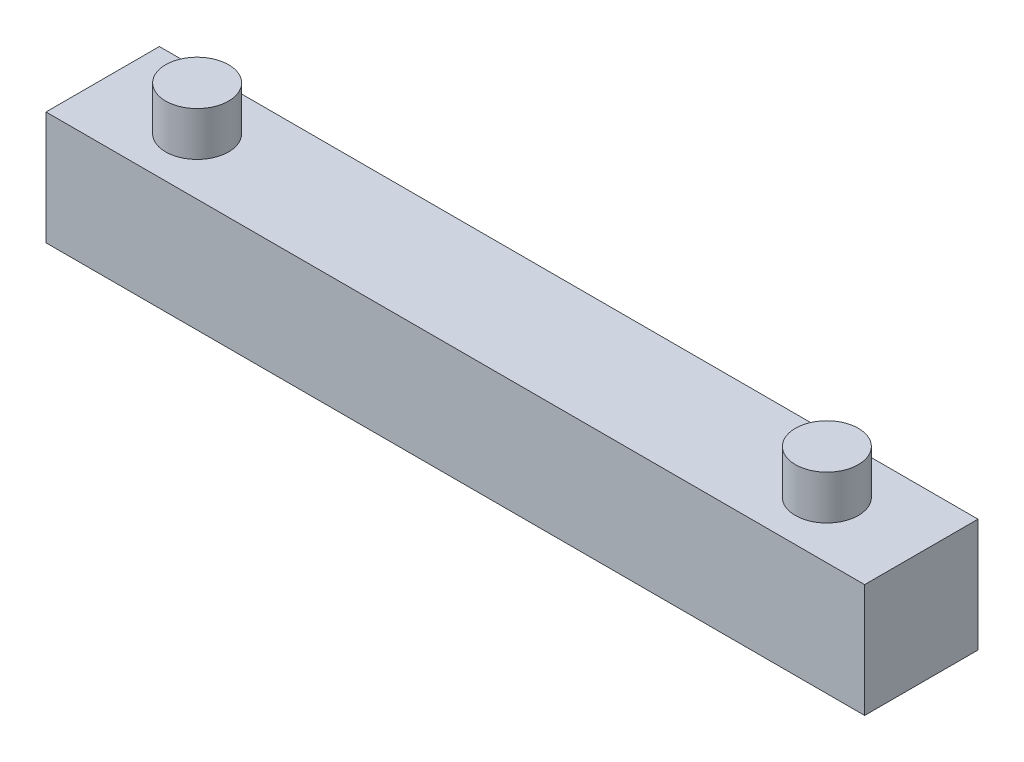
ISO-10303-21;
HEADER;
FILE_DESCRIPTION(('STEP AP214'),'2;1');
FILE_NAME('part.step','',(''),(''),'','','');
FILE_SCHEMA(('AUTOMOTIVE_DESIGN { 1 0 10303 214 1 1 1 1 }'));
ENDSEC;
DATA;
#1=APPLICATION_CONTEXT('core data for automotive mechanical design processes');
#2=APPLICATION_PROTOCOL_DEFINITION('international standard','automotive_design',2000,#1);
#3=PRODUCT_CONTEXT('',#1,'mechanical');
#4=PRODUCT('Part','Part','',(#3));
#5=PRODUCT_RELATED_PRODUCT_CATEGORY('part','',(#4));
#6=PRODUCT_DEFINITION_FORMATION('','',#4);
#7=PRODUCT_DEFINITION_CONTEXT('part definition',#1,'design');
#8=PRODUCT_DEFINITION('design','',#6,#7);
#9=PRODUCT_DEFINITION_SHAPE('','',#8);
#10=(LENGTH_UNIT() NAMED_UNIT(*) SI_UNIT(.MILLI.,.METRE.));
#11=(NAMED_UNIT(*) PLANE_ANGLE_UNIT() SI_UNIT($,.RADIAN.));
#12=(NAMED_UNIT(*) SI_UNIT($,.STERADIAN.) SOLID_ANGLE_UNIT());
#13=UNCERTAINTY_MEASURE_WITH_UNIT(LENGTH_MEASURE(1.E-05),#10,'distance_accuracy_value','');
#14=(GEOMETRIC_REPRESENTATION_CONTEXT(3) GLOBAL_UNCERTAINTY_ASSIGNED_CONTEXT((#13)) GLOBAL_UNIT_ASSIGNED_CONTEXT((#10,
#11,#12)) REPRESENTATION_CONTEXT('',''));
#15=CARTESIAN_POINT('',(0.,0.,0.));
#16=DIRECTION('',(0.,0.,1.));
#17=DIRECTION('',(1.,0.,0.));
#18=AXIS2_PLACEMENT_3D('',#15,#16,#17);
#19=CARTESIAN_POINT('',(0.,9.,0.));
#20=DIRECTION('',(0.,1.,0.));
#21=DIRECTION('',(0.,0.,1.));
#22=AXIS2_PLACEMENT_3D('',#19,#20,#21);
#23=PLANE('',#22);
#24=CARTESIAN_POINT('',(7.5,9.,4.5));
#25=DIRECTION('',(0.,1.,0.));
#26=DIRECTION('',(0.,0.,1.));
#27=AXIS2_PLACEMENT_3D('',#24,#25,#26);
#28=CIRCLE('',#27,2.5);
#29=CARTESIAN_POINT('',(7.5,9.,7.));
#30=VERTEX_POINT('',#29);
#31=EDGE_CURVE('E111',#30,#30,#28,.T.);
#32=ORIENTED_EDGE('',*,*,#31,.F.);
#33=EDGE_LOOP('',(#32));
#34=FACE_BOUND('',#33,.T.);
#35=DIRECTION('',(0.,0.,1.));
#36=VECTOR('',#35,1.);
#37=CARTESIAN_POINT('',(0.,9.,0.));
#38=LINE('',#37,#36);
#39=CARTESIAN_POINT('',(0.,9.,0.));
#40=VERTEX_POINT('',#39);
#41=CARTESIAN_POINT('',(0.,9.,9.));
#42=VERTEX_POINT('',#41);
#43=EDGE_CURVE('E85',#40,#42,#38,.T.);
#44=ORIENTED_EDGE('',*,*,#43,.T.);
#45=DIRECTION('',(1.,0.,0.));
#46=VECTOR('',#45,1.);
#47=CARTESIAN_POINT('',(0.,9.,9.));
#48=LINE('',#47,#46);
#49=CARTESIAN_POINT('',(65.,9.,9.));
#50=VERTEX_POINT('',#49);
#51=EDGE_CURVE('E80',#42,#50,#48,.T.);
#52=ORIENTED_EDGE('',*,*,#51,.T.);
#53=DIRECTION('',(0.,0.,-1.));
#54=VECTOR('',#53,1.);
#55=CARTESIAN_POINT('',(65.,9.,0.));
#56=LINE('',#55,#54);
#57=CARTESIAN_POINT('',(65.,9.,0.));
#58=VERTEX_POINT('',#57);
#59=EDGE_CURVE('E83',#50,#58,#56,.T.);
#60=ORIENTED_EDGE('',*,*,#59,.T.);
#61=DIRECTION('',(-1.,0.,0.));
#62=VECTOR('',#61,1.);
#63=CARTESIAN_POINT('',(0.,9.,0.));
#64=LINE('',#63,#62);
#65=EDGE_CURVE('E50',#58,#40,#64,.T.);
#66=ORIENTED_EDGE('',*,*,#65,.T.);
#67=EDGE_LOOP('',(#44,#52,#60,#66));
#68=FACE_BOUND('',#67,.T.);
#69=CARTESIAN_POINT('',(57.5,9.,4.5));
#70=DIRECTION('',(0.,1.,0.));
#71=DIRECTION('',(0.,0.,1.));
#72=AXIS2_PLACEMENT_3D('',#69,#70,#71);
#73=CIRCLE('',#72,2.5);
#74=CARTESIAN_POINT('',(57.5,9.,7.));
#75=VERTEX_POINT('',#74);
#76=EDGE_CURVE('E117',#75,#75,#73,.T.);
#77=ORIENTED_EDGE('',*,*,#76,.F.);
#78=EDGE_LOOP('',(#77));
#79=FACE_BOUND('',#78,.T.);
#80=ADVANCED_FACE('F33',(#34,#68,#79),#23,.T.);
#81=CARTESIAN_POINT('',(0.,9.,0.));
#82=DIRECTION('',(1.,0.,0.));
#83=DIRECTION('',(0.,0.,-1.));
#84=AXIS2_PLACEMENT_3D('',#81,#82,#83);
#85=PLANE('',#84);
#86=DIRECTION('',(0.,0.,1.));
#87=VECTOR('',#86,1.);
#88=CARTESIAN_POINT('',(0.,0.,0.));
#89=LINE('',#88,#87);
#90=CARTESIAN_POINT('',(0.,0.,0.));
#91=VERTEX_POINT('',#90);
#92=CARTESIAN_POINT('',(0.,0.,9.));
#93=VERTEX_POINT('',#92);
#94=EDGE_CURVE('E97',#91,#93,#89,.T.);
#95=ORIENTED_EDGE('',*,*,#94,.T.);
#96=DIRECTION('',(0.,-1.,0.));
#97=VECTOR('',#96,1.);
#98=CARTESIAN_POINT('',(0.,9.,9.));
#99=LINE('',#98,#97);
#100=EDGE_CURVE('E11',#42,#93,#99,.T.);
#101=ORIENTED_EDGE('',*,*,#100,.F.);
#102=ORIENTED_EDGE('',*,*,#43,.F.);
#103=DIRECTION('',(0.,-1.,0.));
#104=VECTOR('',#103,1.);
#105=CARTESIAN_POINT('',(0.,9.,0.));
#106=LINE('',#105,#104);
#107=EDGE_CURVE('E93',#40,#91,#106,.T.);
#108=ORIENTED_EDGE('',*,*,#107,.T.);
#109=EDGE_LOOP('',(#95,#101,#102,#108));
#110=FACE_BOUND('',#109,.T.);
#111=ADVANCED_FACE('F35',(#110),#85,.F.);
#112=CARTESIAN_POINT('',(0.,9.,9.));
#113=DIRECTION('',(0.,0.,-1.));
#114=DIRECTION('',(-1.,0.,0.));
#115=AXIS2_PLACEMENT_3D('',#112,#113,#114);
#116=PLANE('',#115);
#117=DIRECTION('',(1.,0.,0.));
#118=VECTOR('',#117,1.);
#119=CARTESIAN_POINT('',(0.,0.,9.));
#120=LINE('',#119,#118);
#121=CARTESIAN_POINT('',(65.,0.,9.));
#122=VERTEX_POINT('',#121);
#123=EDGE_CURVE('E89',#93,#122,#120,.T.);
#124=ORIENTED_EDGE('',*,*,#123,.T.);
#125=DIRECTION('',(0.,-1.,0.));
#126=VECTOR('',#125,1.);
#127=CARTESIAN_POINT('',(65.,9.,9.));
#128=LINE('',#127,#126);
#129=EDGE_CURVE('E42',#50,#122,#128,.T.);
#130=ORIENTED_EDGE('',*,*,#129,.F.);
#131=ORIENTED_EDGE('',*,*,#51,.F.);
#132=ORIENTED_EDGE('',*,*,#100,.T.);
#133=EDGE_LOOP('',(#124,#130,#131,#132));
#134=FACE_BOUND('',#133,.T.);
#135=ADVANCED_FACE('F88',(#134),#116,.F.);
#136=CARTESIAN_POINT('',(65.,9.,0.));
#137=DIRECTION('',(-1.,0.,0.));
#138=DIRECTION('',(0.,0.,1.));
#139=AXIS2_PLACEMENT_3D('',#136,#137,#138);
#140=PLANE('',#139);
#141=DIRECTION('',(0.,0.,-1.));
#142=VECTOR('',#141,1.);
#143=CARTESIAN_POINT('',(65.,0.,0.));
#144=LINE('',#143,#142);
#145=CARTESIAN_POINT('',(65.,0.,0.));
#146=VERTEX_POINT('',#145);
#147=EDGE_CURVE('E67',#122,#146,#144,.T.);
#148=ORIENTED_EDGE('',*,*,#147,.T.);
#149=DIRECTION('',(0.,-1.,0.));
#150=VECTOR('',#149,1.);
#151=CARTESIAN_POINT('',(65.,9.,0.));
#152=LINE('',#151,#150);
#153=EDGE_CURVE('E90',#58,#146,#152,.T.);
#154=ORIENTED_EDGE('',*,*,#153,.F.);
#155=ORIENTED_EDGE('',*,*,#59,.F.);
#156=ORIENTED_EDGE('',*,*,#129,.T.);
#157=EDGE_LOOP('',(#148,#154,#155,#156));
#158=FACE_BOUND('',#157,.T.);
#159=ADVANCED_FACE('F91',(#158),#140,.F.);
#160=CARTESIAN_POINT('',(0.,9.,0.));
#161=DIRECTION('',(0.,0.,1.));
#162=DIRECTION('',(1.,0.,0.));
#163=AXIS2_PLACEMENT_3D('',#160,#161,#162);
#164=PLANE('',#163);
#165=DIRECTION('',(-1.,0.,0.));
#166=VECTOR('',#165,1.);
#167=CARTESIAN_POINT('',(0.,0.,0.));
#168=LINE('',#167,#166);
#169=EDGE_CURVE('E73',#146,#91,#168,.T.);
#170=ORIENTED_EDGE('',*,*,#169,.T.);
#171=ORIENTED_EDGE('',*,*,#107,.F.);
#172=ORIENTED_EDGE('',*,*,#65,.F.);
#173=ORIENTED_EDGE('',*,*,#153,.T.);
#174=EDGE_LOOP('',(#170,#171,#172,#173));
#175=FACE_BOUND('',#174,.T.);
#176=ADVANCED_FACE('F105',(#175),#164,.F.);
#177=CARTESIAN_POINT('',(0.,0.,0.));
#178=DIRECTION('',(0.,1.,0.));
#179=DIRECTION('',(0.,0.,1.));
#180=AXIS2_PLACEMENT_3D('',#177,#178,#179);
#181=PLANE('',#180);
#182=ORIENTED_EDGE('',*,*,#94,.F.);
#183=ORIENTED_EDGE('',*,*,#169,.F.);
#184=ORIENTED_EDGE('',*,*,#147,.F.);
#185=ORIENTED_EDGE('',*,*,#123,.F.);
#186=EDGE_LOOP('',(#182,#183,#184,#185));
#187=FACE_BOUND('',#186,.T.);
#188=ADVANCED_FACE('F108',(#187),#181,.F.);
#189=CARTESIAN_POINT('',(7.5,12.5,4.5));
#190=DIRECTION('',(0.,-1.,0.));
#191=DIRECTION('',(0.,0.,-1.));
#192=AXIS2_PLACEMENT_3D('',#189,#190,#191);
#193=CYLINDRICAL_SURFACE('',#192,2.5);
#194=CARTESIAN_POINT('',(7.5,12.5,4.5));
#195=DIRECTION('',(0.,1.,0.));
#196=DIRECTION('',(0.,0.,1.));
#197=AXIS2_PLACEMENT_3D('',#194,#195,#196);
#198=CIRCLE('',#197,2.5);
#199=CARTESIAN_POINT('',(7.5,12.5,7.));
#200=VERTEX_POINT('',#199);
#201=EDGE_CURVE('E100',#200,#200,#198,.T.);
#202=ORIENTED_EDGE('',*,*,#201,.F.);
#203=EDGE_LOOP('',(#202));
#204=FACE_BOUND('',#203,.T.);
#205=ORIENTED_EDGE('',*,*,#31,.T.);
#206=EDGE_LOOP('',(#205));
#207=FACE_BOUND('',#206,.T.);
#208=ADVANCED_FACE('F140',(#204,#207),#193,.T.);
#209=CARTESIAN_POINT('',(7.5,12.5,4.5));
#210=DIRECTION('',(0.,1.,0.));
#211=DIRECTION('',(0.,0.,1.));
#212=AXIS2_PLACEMENT_3D('',#209,#210,#211);
#213=PLANE('',#212);
#214=ORIENTED_EDGE('',*,*,#201,.T.);
#215=EDGE_LOOP('',(#214));
#216=FACE_BOUND('',#215,.T.);
#217=ADVANCED_FACE('F128',(#216),#213,.T.);
#218=CARTESIAN_POINT('',(57.5,12.5,4.5));
#219=DIRECTION('',(0.,-1.,0.));
#220=DIRECTION('',(0.,0.,-1.));
#221=AXIS2_PLACEMENT_3D('',#218,#219,#220);
#222=CYLINDRICAL_SURFACE('',#221,2.5);
#223=CARTESIAN_POINT('',(57.5,12.5,4.5));
#224=DIRECTION('',(0.,1.,0.));
#225=DIRECTION('',(0.,0.,1.));
#226=AXIS2_PLACEMENT_3D('',#223,#224,#225);
#227=CIRCLE('',#226,2.5);
#228=CARTESIAN_POINT('',(57.5,12.5,7.));
#229=VERTEX_POINT('',#228);
#230=EDGE_CURVE('E114',#229,#229,#227,.T.);
#231=ORIENTED_EDGE('',*,*,#230,.F.);
#232=EDGE_LOOP('',(#231));
#233=FACE_BOUND('',#232,.T.);
#234=ORIENTED_EDGE('',*,*,#76,.T.);
#235=EDGE_LOOP('',(#234));
#236=FACE_BOUND('',#235,.T.);
#237=ADVANCED_FACE('F125',(#233,#236),#222,.T.);
#238=CARTESIAN_POINT('',(57.5,12.5,4.5));
#239=DIRECTION('',(0.,1.,0.));
#240=DIRECTION('',(0.,0.,1.));
#241=AXIS2_PLACEMENT_3D('',#238,#239,#240);
#242=PLANE('',#241);
#243=ORIENTED_EDGE('',*,*,#230,.T.);
#244=EDGE_LOOP('',(#243));
#245=FACE_BOUND('',#244,.T.);
#246=ADVANCED_FACE('F123',(#245),#242,.T.);
#247=CLOSED_SHELL('',(#80,#111,#135,#159,#176,#188,#208,#217,#237,#246));
#248=MANIFOLD_SOLID_BREP('B2',#247);
#249=ADVANCED_BREP_SHAPE_REPRESENTATION('',(#18,#248),#14);
#250=SHAPE_DEFINITION_REPRESENTATION(#9,#249);
ENDSEC;
END-ISO-10303-21;
